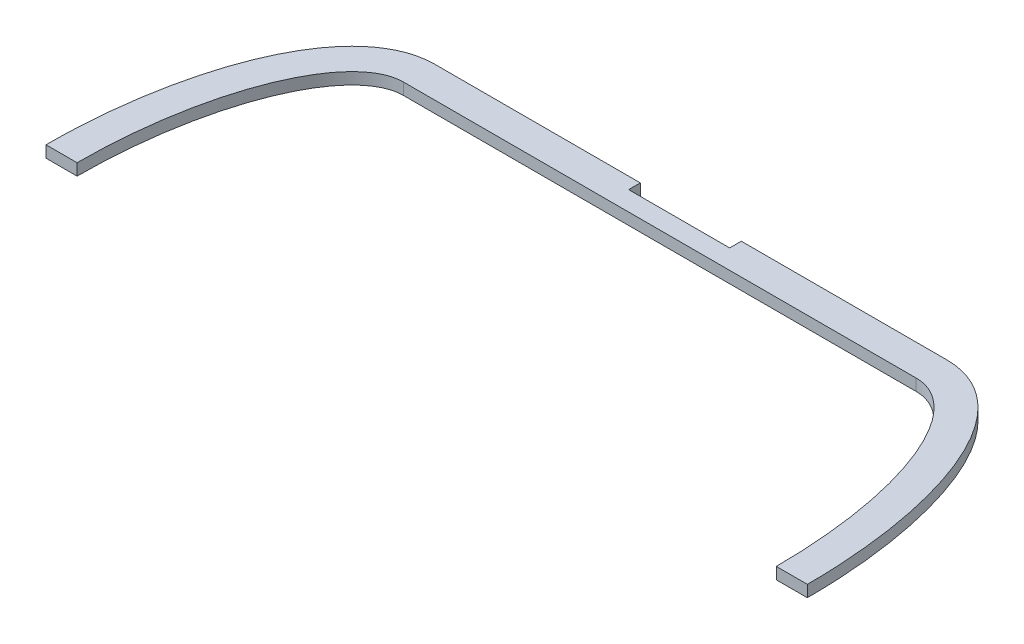
ISO-10303-21;
HEADER;
FILE_DESCRIPTION(('STEP AP214'),'2;1');
FILE_NAME('part.step','',(''),(''),'','','');
FILE_SCHEMA(('AUTOMOTIVE_DESIGN { 1 0 10303 214 1 1 1 1 }'));
ENDSEC;
DATA;
#1=APPLICATION_CONTEXT('core data for automotive mechanical design processes');
#2=APPLICATION_PROTOCOL_DEFINITION('international standard','automotive_design',2000,#1);
#3=PRODUCT_CONTEXT('',#1,'mechanical');
#4=PRODUCT('Part','Part','',(#3));
#5=PRODUCT_RELATED_PRODUCT_CATEGORY('part','',(#4));
#6=PRODUCT_DEFINITION_FORMATION('','',#4);
#7=PRODUCT_DEFINITION_CONTEXT('part definition',#1,'design');
#8=PRODUCT_DEFINITION('design','',#6,#7);
#9=PRODUCT_DEFINITION_SHAPE('','',#8);
#10=(LENGTH_UNIT() NAMED_UNIT(*) SI_UNIT(.MILLI.,.METRE.));
#11=(NAMED_UNIT(*) PLANE_ANGLE_UNIT() SI_UNIT($,.RADIAN.));
#12=(NAMED_UNIT(*) SI_UNIT($,.STERADIAN.) SOLID_ANGLE_UNIT());
#13=UNCERTAINTY_MEASURE_WITH_UNIT(LENGTH_MEASURE(1.E-05),#10,'distance_accuracy_value','');
#14=(GEOMETRIC_REPRESENTATION_CONTEXT(3) GLOBAL_UNCERTAINTY_ASSIGNED_CONTEXT((#13)) GLOBAL_UNIT_ASSIGNED_CONTEXT((#10,
#11,#12)) REPRESENTATION_CONTEXT('',''));
#15=CARTESIAN_POINT('',(0.,0.,0.));
#16=DIRECTION('',(0.,0.,1.));
#17=DIRECTION('',(1.,0.,0.));
#18=AXIS2_PLACEMENT_3D('',#15,#16,#17);
#19=CARTESIAN_POINT('',(-33.,1.5,-34.));
#20=DIRECTION('',(0.,0.,-1.));
#21=DIRECTION('',(-1.,0.,0.));
#22=AXIS2_PLACEMENT_3D('',#19,#20,#21);
#23=PLANE('',#22);
#24=DIRECTION('',(0.,1.,0.));
#25=VECTOR('',#24,1.);
#26=CARTESIAN_POINT('',(-6.5,1.5,-34.));
#27=LINE('',#26,#25);
#28=CARTESIAN_POINT('',(-6.5,0.,-34.));
#29=VERTEX_POINT('',#28);
#30=CARTESIAN_POINT('',(-6.5,1.5,-34.));
#31=VERTEX_POINT('',#30);
#32=EDGE_CURVE('E11',#29,#31,#27,.T.);
#33=ORIENTED_EDGE('',*,*,#32,.F.);
#34=DIRECTION('',(1.,0.,0.));
#35=VECTOR('',#34,1.);
#36=CARTESIAN_POINT('',(-33.,0.,-34.));
#37=LINE('',#36,#35);
#38=CARTESIAN_POINT('',(-33.,0.,-34.));
#39=VERTEX_POINT('',#38);
#40=EDGE_CURVE('E155',#39,#29,#37,.T.);
#41=ORIENTED_EDGE('',*,*,#40,.F.);
#42=DIRECTION('',(0.,-1.,0.));
#43=VECTOR('',#42,1.);
#44=CARTESIAN_POINT('',(-33.,1.5,-34.));
#45=LINE('',#44,#43);
#46=CARTESIAN_POINT('',(-33.,1.5,-34.));
#47=VERTEX_POINT('',#46);
#48=EDGE_CURVE('E249',#47,#39,#45,.T.);
#49=ORIENTED_EDGE('',*,*,#48,.F.);
#50=DIRECTION('',(1.,0.,0.));
#51=VECTOR('',#50,1.);
#52=CARTESIAN_POINT('',(-33.,1.5,-34.));
#53=LINE('',#52,#51);
#54=EDGE_CURVE('E232',#47,#31,#53,.T.);
#55=ORIENTED_EDGE('',*,*,#54,.T.);
#56=EDGE_LOOP('',(#33,#41,#49,#55));
#57=FACE_BOUND('',#56,.T.);
#58=ADVANCED_FACE('F40',(#57),#23,.T.);
#59=CARTESIAN_POINT('',(-33.,1.5,0.));
#60=DIRECTION('',(0.,1.,0.));
#61=DIRECTION('',(0.,0.,1.));
#62=AXIS2_PLACEMENT_3D('',#59,#60,#61);
#63=ELLIPSE('',#62,30.,12.);
#64=DIRECTION('',(0.,-1.,0.));
#65=VECTOR('',#64,1.);
#66=SURFACE_OF_LINEAR_EXTRUSION('',#63,#65);
#67=OFFSET_SURFACE('',#66,-4.,.F.);
#68=DIRECTION('',(0.,-1.,0.));
#69=VECTOR('',#68,1.);
#70=CARTESIAN_POINT('',(-49.,0.75,0.));
#71=LINE('',#70,#69);
#72=CARTESIAN_POINT('',(-49.,1.5,0.));
#73=VERTEX_POINT('',#72);
#74=CARTESIAN_POINT('',(-49.,0.,0.));
#75=VERTEX_POINT('',#74);
#76=EDGE_CURVE('E184',#73,#75,#71,.T.);
#77=ORIENTED_EDGE('',*,*,#76,.F.);
#78=CARTESIAN_POINT('',(-33.,1.5,-34.));
#79=CARTESIAN_POINT('',(-33.1318594620977,1.5,-34.0000020599482));
#80=CARTESIAN_POINT('',(-33.2637006242787,1.5,-33.9970355341147));
#81=CARTESIAN_POINT('',(-33.5271110870535,1.5,-33.9851930390177));
#82=CARTESIAN_POINT('',(-33.6586804003457,1.5,-33.9763173523343));
#83=CARTESIAN_POINT('',(-34.0524260475535,1.5,-33.9408875606357));
#84=CARTESIAN_POINT('',(-34.3138623381053,1.5,-33.9055306264686));
#85=CARTESIAN_POINT('',(-34.8305964091808,1.5,-33.8123523725608));
#86=CARTESIAN_POINT('',(-35.0859257064015,1.5,-33.7547034487541));
#87=CARTESIAN_POINT('',(-35.5907917224365,1.5,-33.6179530744078));
#88=CARTESIAN_POINT('',(-35.8403278339926,1.5,-33.5388493858422));
#89=CARTESIAN_POINT('',(-36.3314711921855,1.5,-33.3607489952492));
#90=CARTESIAN_POINT('',(-36.573096455771,1.5,-33.2618017754368));
#91=CARTESIAN_POINT('',(-37.0479953394521,1.5,-33.0453975077983));
#92=CARTESIAN_POINT('',(-37.2812656129938,1.5,-32.9279331425494));
#93=CARTESIAN_POINT('',(-37.7388156571645,1.5,-32.6760332027823));
#94=CARTESIAN_POINT('',(-37.9630835644682,1.5,-32.5415761440126));
#95=CARTESIAN_POINT('',(-38.4018347424355,1.5,-32.2575102434145));
#96=CARTESIAN_POINT('',(-38.6163154961852,1.5,-32.1078975355798));
#97=CARTESIAN_POINT('',(-39.1532543402919,1.5,-31.7071041076178));
#98=CARTESIAN_POINT('',(-39.4684770078507,1.5,-31.4461846903361));
#99=CARTESIAN_POINT('',(-40.0745432389481,1.5,-30.8974107755337));
#100=CARTESIAN_POINT('',(-40.3653740258298,1.5,-30.6095423269061));
#101=CARTESIAN_POINT('',(-40.924294013386,1.5,-30.0114514760985));
#102=CARTESIAN_POINT('',(-41.1923320370166,1.5,-29.701181518627));
#103=CARTESIAN_POINT('',(-41.7066164563929,1.5,-29.0630483204643));
#104=CARTESIAN_POINT('',(-41.9528563480091,1.5,-28.7351798752964));
#105=CARTESIAN_POINT('',(-42.4712972529298,1.5,-28.0000642978313));
#106=CARTESIAN_POINT('',(-42.7392063418082,1.5,-27.5897993430692));
#107=CARTESIAN_POINT('',(-43.2494781947508,1.5,-26.7534139120122));
#108=CARTESIAN_POINT('',(-43.4918229407119,1.5,-26.3272825352882));
#109=CARTESIAN_POINT('',(-43.9535344011357,1.5,-25.4626566854945));
#110=CARTESIAN_POINT('',(-44.1728945430332,1.5,-25.0241587213834));
#111=CARTESIAN_POINT('',(-44.59130669948,1.5,-24.1366034231867));
#112=CARTESIAN_POINT('',(-44.7903190489005,1.5,-23.6875274883149));
#113=CARTESIAN_POINT('',(-45.1694966695557,1.5,-22.7817322494237));
#114=CARTESIAN_POINT('',(-45.3496694061485,1.5,-22.3250160567792));
#115=CARTESIAN_POINT('',(-45.6929528702929,1.5,-21.4052442104853));
#116=CARTESIAN_POINT('',(-45.856063669406,1.5,-20.942188583434));
#117=CARTESIAN_POINT('',(-46.1764891399855,1.5,-19.9813818243689));
#118=CARTESIAN_POINT('',(-46.3327822108289,1.5,-19.483290910703));
#119=CARTESIAN_POINT('',(-46.6291342184352,1.5,-18.4822739248874));
#120=CARTESIAN_POINT('',(-46.7691917170414,1.5,-17.9793474286655));
#121=CARTESIAN_POINT('',(-47.0343446224069,1.5,-16.9691716008346));
#122=CARTESIAN_POINT('',(-47.1594286517896,1.5,-16.461919291893));
#123=CARTESIAN_POINT('',(-47.3955073552352,1.5,-15.4441265624587));
#124=CARTESIAN_POINT('',(-47.5065012265865,1.5,-14.9335859563724));
#125=CARTESIAN_POINT('',(-47.7152506631777,1.5,-13.9096322212036));
#126=CARTESIAN_POINT('',(-47.8130017850487,1.5,-13.3962181878666));
#127=CARTESIAN_POINT('',(-47.9959021200888,1.5,-12.3671432744908));
#128=CARTESIAN_POINT('',(-48.0810508090306,1.5,-11.8514823019032));
#129=CARTESIAN_POINT('',(-48.3189822028628,1.5,-10.2983699369656));
#130=CARTESIAN_POINT('',(-48.453586223143,1.5,-9.25808852451466));
#131=CARTESIAN_POINT('',(-48.6777395263624,1.5,-7.17331636462823));
#132=CARTESIAN_POINT('',(-48.7673118072923,1.5,-6.12882804099582));
#133=CARTESIAN_POINT('',(-48.9035866922487,1.5,-4.03720573631824));
#134=CARTESIAN_POINT('',(-48.9502953565059,1.5,-2.99007215026959));
#135=CARTESIAN_POINT('',(-48.9979304608906,1.5,-1.05601569894444));
#136=CARTESIAN_POINT('',(-49.0047953518082,1.5,-0.169232157102556));
#137=CARTESIAN_POINT('',(-48.9886876788915,1.5,1.60419145579057));
#138=CARTESIAN_POINT('',(-48.9657111539563,1.5,2.49083149216792));
#139=CARTESIAN_POINT('',(-48.8895397901809,1.5,4.26308182212891));
#140=CARTESIAN_POINT('',(-48.8363359757705,1.5,5.14869173152721));
#141=CARTESIAN_POINT('',(-48.6987998662974,1.5,6.91798779564072));
#142=CARTESIAN_POINT('',(-48.614450737541,1.5,7.80167264959111));
#143=CARTESIAN_POINT('',(-48.4137441725008,1.5,9.56055225063439));
#144=CARTESIAN_POINT('',(-48.2975634838848,1.5,10.4357670281672));
#145=CARTESIAN_POINT('',(-48.0309519792693,1.5,12.1808466106661));
#146=CARTESIAN_POINT('',(-47.8805265524154,1.5,13.0507122353385));
#147=CARTESIAN_POINT('',(-47.5426449389393,1.5,14.7826673737946));
#148=CARTESIAN_POINT('',(-47.3552157164466,1.5,15.644762074639));
#149=CARTESIAN_POINT('',(-47.0433430253094,1.5,16.9300967030071));
#150=CARTESIAN_POINT('',(-46.9343030574677,1.5,17.3571074332168));
#151=CARTESIAN_POINT('',(-46.705323876174,1.5,18.2081897849636));
#152=CARTESIAN_POINT('',(-46.5853850963297,1.5,18.6322615227062));
#153=CARTESIAN_POINT('',(-46.3099613701162,1.5,19.5572920151293));
#154=CARTESIAN_POINT('',(-46.1520544438863,1.5,20.057533520389));
#155=CARTESIAN_POINT('',(-45.8183166797773,1.5,21.0519989533086));
#156=CARTESIAN_POINT('',(-45.642486626955,1.5,21.5462231434742));
#157=CARTESIAN_POINT('',(-45.2708565317141,1.5,22.5279730394365));
#158=CARTESIAN_POINT('',(-45.0750274579593,1.5,23.0154878072719));
#159=CARTESIAN_POINT('',(-44.661479868201,1.5,23.9811878173337));
#160=CARTESIAN_POINT('',(-44.44376152471,1.5,24.4593731330514));
#161=CARTESIAN_POINT('',(-43.981992283357,1.5,25.4077760171269));
#162=CARTESIAN_POINT('',(-43.7377404767102,1.5,25.8778963596938));
#163=CARTESIAN_POINT('',(-43.2212194112808,1.5,26.8027348642167));
#164=CARTESIAN_POINT('',(-42.9489444140762,1.5,27.2574498461149));
#165=CARTESIAN_POINT('',(-42.3735126923934,1.5,28.1456018489968));
#166=CARTESIAN_POINT('',(-42.0704261602621,1.5,28.5790840418468));
#167=CARTESIAN_POINT('',(-41.4291529915261,1.5,29.4192156910943));
#168=CARTESIAN_POINT('',(-41.0909897691264,1.5,29.8258827541572));
#169=CARTESIAN_POINT('',(-40.5278308199835,1.5,30.4385851206157));
#170=CARTESIAN_POINT('',(-40.3157240969554,1.5,30.6565141601795));
#171=CARTESIAN_POINT('',(-39.878127855667,1.5,31.0786383339111));
#172=CARTESIAN_POINT('',(-39.6526365904152,1.5,31.2828316677996));
#173=CARTESIAN_POINT('',(-39.1879603805882,1.5,31.6751775758266));
#174=CARTESIAN_POINT('',(-38.9487721248127,1.5,31.8633262436252));
#175=CARTESIAN_POINT('',(-38.4568919659684,1.5,32.2209113286117));
#176=CARTESIAN_POINT('',(-38.204205918611,1.5,32.390355763932));
#177=CARTESIAN_POINT('',(-37.6826037333005,1.5,32.7098471927893));
#178=CARTESIAN_POINT('',(-37.4135290937558,1.5,32.8596367230878));
#179=CARTESIAN_POINT('',(-36.8629856959038,1.5,33.1346097997704));
#180=CARTESIAN_POINT('',(-36.5815153949178,1.5,33.2597902728279));
#181=CARTESIAN_POINT('',(-36.0085391685868,1.5,33.4826454962346));
#182=CARTESIAN_POINT('',(-35.7170562164389,1.5,33.5803790342088));
#183=CARTESIAN_POINT('',(-35.125969633301,1.5,33.7463976127401));
#184=CARTESIAN_POINT('',(-34.8263712656585,1.5,33.8147012763248));
#185=CARTESIAN_POINT('',(-34.2725560161592,1.5,33.9114016006083));
#186=CARTESIAN_POINT('',(-34.0191717396856,1.5,33.9445750899428));
#187=CARTESIAN_POINT('',(-33.6377179083465,1.5,33.9778013169971));
#188=CARTESIAN_POINT('',(-33.5103278684717,1.5,33.986121061806));
#189=CARTESIAN_POINT('',(-33.2552966943805,1.5,33.9972218002038));
#190=CARTESIAN_POINT('',(-33.1276555410585,1.5,34.0000023546415));
#191=CARTESIAN_POINT('',(-33.,1.5,34.));
#192=B_SPLINE_CURVE_WITH_KNOTS('',3,(#78,#79,#80,#81,#82,#83,#84,#85,#86,#87,#88,#89,#90,#91,
#92,#93,#94,#95,#96,#97,#98,#99,#100,#101,#102,#103,#104,#105,#106,#107,#108,#109,#110,#111,
#112,#113,#114,#115,#116,#117,#118,#119,#120,#121,#122,#123,#124,#125,#126,#127,#128,#129,#130,
#131,#132,#133,#134,#135,#136,#137,#138,#139,#140,#141,#142,#143,#144,#145,#146,#147,#148,#149,
#150,#151,#152,#153,#154,#155,#156,#157,#158,#159,#160,#161,#162,#163,#164,#165,#166,#167,#168,
#169,#170,#171,#172,#173,#174,#175,#176,#177,#178,#179,#180,#181,#182,#183,#184,#185,#186,#187,
#188,#189,#190,#191),.UNSPECIFIED.,.F.,.F.,(4,2,2,2,2,2,2,2,2,2,2,2,2,2,2,2,2,2,2,2,2,2,2,2,2,2,
2,2,2,2,2,2,2,2,2,2,2,2,2,2,2,2,2,2,2,2,2,2,2,2,2,2,2,2,2,2,4),(0.,0.395508836014187,
0.790998759870364,1.58131428167553,2.3656363114628,3.15004018827493,3.93251185206918,
4.71529350401624,5.49907493574531,6.28305680565762,7.50867229476685,8.7349258126237,
9.96386370828232,11.1931670672531,12.6620278715481,14.1319171277453,15.6022255657429,
17.0753476019005,18.5478836708645,20.0204135634422,21.5862179857611,23.1521610021457,
24.7192864253178,26.2865010870783,27.8542403042732,29.4220447168738,32.5677400507569,
35.7118272222425,38.8554698015129,41.5154187918589,44.1757208955869,46.8368133519216,
49.499346209299,52.147384676482,54.7950067056158,57.4407065247341,58.7627261438731,
60.0846931896487,61.6580971759044,63.231432274565,64.8070846568383,66.3827246221411,
67.9712586192657,69.5601185565721,71.1454367174265,72.7297033832918,73.6415262024059,
74.5534682982544,75.4656317913664,76.3774027270191,77.3001263347647,78.2229651046637,
79.1438119355043,80.0640752017713,80.8297204129566,81.2125979873055,81.5955059152856),.UNSPECIFIED.);
#193=EDGE_CURVE('E215',#47,#73,#192,.T.);
#194=ORIENTED_EDGE('',*,*,#193,.F.);
#195=ORIENTED_EDGE('',*,*,#48,.T.);
#196=CARTESIAN_POINT('',(-33.,0.,-34.));
#197=CARTESIAN_POINT('',(-33.1318594620977,0.,-34.0000020599482));
#198=CARTESIAN_POINT('',(-33.2637006242787,0.,-33.9970355341147));
#199=CARTESIAN_POINT('',(-33.5271110870535,0.,-33.9851930390177));
#200=CARTESIAN_POINT('',(-33.6586804003457,0.,-33.9763173523343));
#201=CARTESIAN_POINT('',(-34.0524260475535,0.,-33.9408875606357));
#202=CARTESIAN_POINT('',(-34.3138623381053,0.,-33.9055306264686));
#203=CARTESIAN_POINT('',(-34.8305964091808,0.,-33.8123523725608));
#204=CARTESIAN_POINT('',(-35.0859257064015,0.,-33.7547034487541));
#205=CARTESIAN_POINT('',(-35.5907917224365,0.,-33.6179530744078));
#206=CARTESIAN_POINT('',(-35.8403278339926,0.,-33.5388493858422));
#207=CARTESIAN_POINT('',(-36.3314711921855,0.,-33.3607489952492));
#208=CARTESIAN_POINT('',(-36.573096455771,0.,-33.2618017754368));
#209=CARTESIAN_POINT('',(-37.0479953394521,0.,-33.0453975077983));
#210=CARTESIAN_POINT('',(-37.2812656129938,0.,-32.9279331425494));
#211=CARTESIAN_POINT('',(-37.7388156571645,0.,-32.6760332027823));
#212=CARTESIAN_POINT('',(-37.9630835644682,0.,-32.5415761440126));
#213=CARTESIAN_POINT('',(-38.4018347424355,0.,-32.2575102434145));
#214=CARTESIAN_POINT('',(-38.6163154961852,0.,-32.1078975355798));
#215=CARTESIAN_POINT('',(-39.1532543402919,0.,-31.7071041076178));
#216=CARTESIAN_POINT('',(-39.4684770078507,0.,-31.4461846903361));
#217=CARTESIAN_POINT('',(-40.0745432389481,0.,-30.8974107755337));
#218=CARTESIAN_POINT('',(-40.3653740258298,0.,-30.6095423269061));
#219=CARTESIAN_POINT('',(-40.924294013386,0.,-30.0114514760985));
#220=CARTESIAN_POINT('',(-41.1923320370166,0.,-29.701181518627));
#221=CARTESIAN_POINT('',(-41.7066164563929,0.,-29.0630483204643));
#222=CARTESIAN_POINT('',(-41.9528563480091,0.,-28.7351798752964));
#223=CARTESIAN_POINT('',(-42.4712972529298,0.,-28.0000642978313));
#224=CARTESIAN_POINT('',(-42.7392063418082,0.,-27.5897993430692));
#225=CARTESIAN_POINT('',(-43.2494781947508,0.,-26.7534139120122));
#226=CARTESIAN_POINT('',(-43.4918229407119,0.,-26.3272825352882));
#227=CARTESIAN_POINT('',(-43.9535344011357,0.,-25.4626566854945));
#228=CARTESIAN_POINT('',(-44.1728945430332,0.,-25.0241587213834));
#229=CARTESIAN_POINT('',(-44.59130669948,0.,-24.1366034231867));
#230=CARTESIAN_POINT('',(-44.7903190489005,0.,-23.6875274883149));
#231=CARTESIAN_POINT('',(-45.1694966695557,0.,-22.7817322494237));
#232=CARTESIAN_POINT('',(-45.3496694061485,0.,-22.3250160567792));
#233=CARTESIAN_POINT('',(-45.6929528702929,0.,-21.4052442104853));
#234=CARTESIAN_POINT('',(-45.856063669406,0.,-20.942188583434));
#235=CARTESIAN_POINT('',(-46.1764891399855,0.,-19.9813818243689));
#236=CARTESIAN_POINT('',(-46.3327822108289,0.,-19.483290910703));
#237=CARTESIAN_POINT('',(-46.6291342184352,0.,-18.4822739248874));
#238=CARTESIAN_POINT('',(-46.7691917170414,0.,-17.9793474286655));
#239=CARTESIAN_POINT('',(-47.0343446224069,0.,-16.9691716008346));
#240=CARTESIAN_POINT('',(-47.1594286517896,0.,-16.461919291893));
#241=CARTESIAN_POINT('',(-47.3955073552352,0.,-15.4441265624587));
#242=CARTESIAN_POINT('',(-47.5065012265865,0.,-14.9335859563724));
#243=CARTESIAN_POINT('',(-47.7152506631777,0.,-13.9096322212036));
#244=CARTESIAN_POINT('',(-47.8130017850487,0.,-13.3962181878666));
#245=CARTESIAN_POINT('',(-47.9959021200888,0.,-12.3671432744908));
#246=CARTESIAN_POINT('',(-48.0810508090306,0.,-11.8514823019032));
#247=CARTESIAN_POINT('',(-48.3189822028628,0.,-10.2983699369656));
#248=CARTESIAN_POINT('',(-48.453586223143,0.,-9.25808852451466));
#249=CARTESIAN_POINT('',(-48.6777395263624,0.,-7.17331636462823));
#250=CARTESIAN_POINT('',(-48.7673118072923,0.,-6.12882804099582));
#251=CARTESIAN_POINT('',(-48.9035866922487,0.,-4.03720573631824));
#252=CARTESIAN_POINT('',(-48.9502953565059,0.,-2.99007215026959));
#253=CARTESIAN_POINT('',(-48.9979304608906,0.,-1.05601569894444));
#254=CARTESIAN_POINT('',(-49.0047953518082,0.,-0.169232157102556));
#255=CARTESIAN_POINT('',(-48.9886876788915,0.,1.60419145579057));
#256=CARTESIAN_POINT('',(-48.9657111539563,0.,2.49083149216792));
#257=CARTESIAN_POINT('',(-48.8895397901809,0.,4.26308182212891));
#258=CARTESIAN_POINT('',(-48.8363359757705,0.,5.14869173152721));
#259=CARTESIAN_POINT('',(-48.6987998662974,0.,6.91798779564072));
#260=CARTESIAN_POINT('',(-48.614450737541,0.,7.80167264959111));
#261=CARTESIAN_POINT('',(-48.4137441725008,0.,9.56055225063439));
#262=CARTESIAN_POINT('',(-48.2975634838848,0.,10.4357670281672));
#263=CARTESIAN_POINT('',(-48.0309519792693,0.,12.1808466106661));
#264=CARTESIAN_POINT('',(-47.8805265524154,0.,13.0507122353385));
#265=CARTESIAN_POINT('',(-47.5426449389393,0.,14.7826673737946));
#266=CARTESIAN_POINT('',(-47.3552157164466,0.,15.644762074639));
#267=CARTESIAN_POINT('',(-47.0433430253094,0.,16.9300967030071));
#268=CARTESIAN_POINT('',(-46.9343030574677,0.,17.3571074332168));
#269=CARTESIAN_POINT('',(-46.705323876174,0.,18.2081897849636));
#270=CARTESIAN_POINT('',(-46.5853850963297,0.,18.6322615227062));
#271=CARTESIAN_POINT('',(-46.3099613701162,0.,19.5572920151293));
#272=CARTESIAN_POINT('',(-46.1520544438863,0.,20.057533520389));
#273=CARTESIAN_POINT('',(-45.8183166797773,0.,21.0519989533086));
#274=CARTESIAN_POINT('',(-45.642486626955,0.,21.5462231434742));
#275=CARTESIAN_POINT('',(-45.2708565317141,0.,22.5279730394365));
#276=CARTESIAN_POINT('',(-45.0750274579593,0.,23.0154878072719));
#277=CARTESIAN_POINT('',(-44.661479868201,0.,23.9811878173337));
#278=CARTESIAN_POINT('',(-44.44376152471,0.,24.4593731330514));
#279=CARTESIAN_POINT('',(-43.981992283357,0.,25.4077760171269));
#280=CARTESIAN_POINT('',(-43.7377404767102,0.,25.8778963596938));
#281=CARTESIAN_POINT('',(-43.2212194112808,0.,26.8027348642167));
#282=CARTESIAN_POINT('',(-42.9489444140762,0.,27.2574498461149));
#283=CARTESIAN_POINT('',(-42.3735126923934,0.,28.1456018489968));
#284=CARTESIAN_POINT('',(-42.0704261602621,0.,28.5790840418468));
#285=CARTESIAN_POINT('',(-41.4291529915261,0.,29.4192156910943));
#286=CARTESIAN_POINT('',(-41.0909897691264,0.,29.8258827541572));
#287=CARTESIAN_POINT('',(-40.5278308199835,0.,30.4385851206157));
#288=CARTESIAN_POINT('',(-40.3157240969554,0.,30.6565141601795));
#289=CARTESIAN_POINT('',(-39.878127855667,0.,31.0786383339111));
#290=CARTESIAN_POINT('',(-39.6526365904152,0.,31.2828316677996));
#291=CARTESIAN_POINT('',(-39.1879603805882,0.,31.6751775758266));
#292=CARTESIAN_POINT('',(-38.9487721248127,0.,31.8633262436252));
#293=CARTESIAN_POINT('',(-38.4568919659684,0.,32.2209113286117));
#294=CARTESIAN_POINT('',(-38.204205918611,0.,32.390355763932));
#295=CARTESIAN_POINT('',(-37.6826037333005,0.,32.7098471927893));
#296=CARTESIAN_POINT('',(-37.4135290937558,0.,32.8596367230878));
#297=CARTESIAN_POINT('',(-36.8629856959038,0.,33.1346097997704));
#298=CARTESIAN_POINT('',(-36.5815153949178,0.,33.2597902728279));
#299=CARTESIAN_POINT('',(-36.0085391685868,0.,33.4826454962346));
#300=CARTESIAN_POINT('',(-35.7170562164389,0.,33.5803790342088));
#301=CARTESIAN_POINT('',(-35.125969633301,0.,33.7463976127401));
#302=CARTESIAN_POINT('',(-34.8263712656585,0.,33.8147012763248));
#303=CARTESIAN_POINT('',(-34.2725560161592,0.,33.9114016006083));
#304=CARTESIAN_POINT('',(-34.0191717396856,0.,33.9445750899428));
#305=CARTESIAN_POINT('',(-33.6377179083465,0.,33.9778013169971));
#306=CARTESIAN_POINT('',(-33.5103278684717,0.,33.986121061806));
#307=CARTESIAN_POINT('',(-33.2552966943805,0.,33.9972218002038));
#308=CARTESIAN_POINT('',(-33.1276555410585,0.,34.0000023546415));
#309=CARTESIAN_POINT('',(-33.,0.,34.));
#310=B_SPLINE_CURVE_WITH_KNOTS('',3,(#196,#197,#198,#199,#200,#201,#202,#203,#204,#205,#206,
#207,#208,#209,#210,#211,#212,#213,#214,#215,#216,#217,#218,#219,#220,#221,#222,#223,#224,#225,
#226,#227,#228,#229,#230,#231,#232,#233,#234,#235,#236,#237,#238,#239,#240,#241,#242,#243,#244,
#245,#246,#247,#248,#249,#250,#251,#252,#253,#254,#255,#256,#257,#258,#259,#260,#261,#262,#263,
#264,#265,#266,#267,#268,#269,#270,#271,#272,#273,#274,#275,#276,#277,#278,#279,#280,#281,#282,
#283,#284,#285,#286,#287,#288,#289,#290,#291,#292,#293,#294,#295,#296,#297,#298,#299,#300,#301,
#302,#303,#304,#305,#306,#307,#308,#309),.UNSPECIFIED.,.F.,.F.,(4,2,2,2,2,2,2,2,2,2,2,2,2,2,2,2,
2,2,2,2,2,2,2,2,2,2,2,2,2,2,2,2,2,2,2,2,2,2,2,2,2,2,2,2,2,2,2,2,2,2,2,2,2,2,2,2,4),(0.,
0.395508836014187,0.790998759870364,1.58131428167553,2.3656363114628,3.15004018827493,
3.93251185206918,4.71529350401624,5.49907493574531,6.28305680565762,7.50867229476685,
8.7349258126237,9.96386370828232,11.1931670672531,12.6620278715481,14.1319171277453,
15.6022255657429,17.0753476019005,18.5478836708645,20.0204135634422,21.5862179857611,
23.1521610021457,24.7192864253178,26.2865010870783,27.8542403042732,29.4220447168738,
32.5677400507569,35.7118272222425,38.8554698015129,41.5154187918589,44.1757208955869,
46.8368133519216,49.499346209299,52.147384676482,54.7950067056158,57.4407065247341,
58.7627261438731,60.0846931896487,61.6580971759044,63.231432274565,64.8070846568383,
66.3827246221411,67.9712586192657,69.5601185565721,71.1454367174265,72.7297033832918,
73.6415262024059,74.5534682982544,75.4656317913664,76.3774027270191,77.3001263347647,
78.2229651046637,79.1438119355043,80.0640752017713,80.8297204129566,81.2125979873055,
81.5955059152856),.UNSPECIFIED.);
#311=EDGE_CURVE('E257',#39,#75,#310,.T.);
#312=ORIENTED_EDGE('',*,*,#311,.T.);
#313=EDGE_LOOP('',(#77,#194,#195,#312));
#314=FACE_BOUND('',#313,.T.);
#315=ADVANCED_FACE('F236',(#314),#67,.F.);
#316=CARTESIAN_POINT('',(33.,1.5,0.));
#317=DIRECTION('',(0.,-1.,0.));
#318=DIRECTION('',(0.,0.,1.));
#319=AXIS2_PLACEMENT_3D('',#316,#317,#318);
#320=ELLIPSE('',#319,30.,12.);
#321=DIRECTION('',(0.,-1.,0.));
#322=VECTOR('',#321,1.);
#323=SURFACE_OF_LINEAR_EXTRUSION('',#320,#322);
#324=OFFSET_SURFACE('',#323,4.,.F.);
#325=CARTESIAN_POINT('',(33.,1.5,-34.));
#326=CARTESIAN_POINT('',(33.1318594620977,1.5,-34.0000020599482));
#327=CARTESIAN_POINT('',(33.2637006242787,1.5,-33.9970355341147));
#328=CARTESIAN_POINT('',(33.5271110870536,1.5,-33.9851930390177));
#329=CARTESIAN_POINT('',(33.6586804003457,1.5,-33.9763173523343));
#330=CARTESIAN_POINT('',(34.0524260475535,1.5,-33.9408875606357));
#331=CARTESIAN_POINT('',(34.3138623381053,1.5,-33.9055306264686));
#332=CARTESIAN_POINT('',(34.8305964091809,1.5,-33.8123523725608));
#333=CARTESIAN_POINT('',(35.0859257064015,1.5,-33.7547034487541));
#334=CARTESIAN_POINT('',(35.5907917224366,1.5,-33.6179530744078));
#335=CARTESIAN_POINT('',(35.8403278339927,1.5,-33.5388493858422));
#336=CARTESIAN_POINT('',(36.3314711921855,1.5,-33.3607489952492));
#337=CARTESIAN_POINT('',(36.573096455771,1.5,-33.2618017754368));
#338=CARTESIAN_POINT('',(37.0479953394522,1.5,-33.0453975077983));
#339=CARTESIAN_POINT('',(37.2812656129938,1.5,-32.9279331425494));
#340=CARTESIAN_POINT('',(37.7388156571646,1.5,-32.6760332027822));
#341=CARTESIAN_POINT('',(37.9630835644682,1.5,-32.5415761440126));
#342=CARTESIAN_POINT('',(38.4018347424356,1.5,-32.2575102434144));
#343=CARTESIAN_POINT('',(38.6163154961852,1.5,-32.1078975355798));
#344=CARTESIAN_POINT('',(39.1532543402919,1.5,-31.7071041076178));
#345=CARTESIAN_POINT('',(39.4684770078507,1.5,-31.446184690336));
#346=CARTESIAN_POINT('',(40.0745432389481,1.5,-30.8974107755336));
#347=CARTESIAN_POINT('',(40.3653740258299,1.5,-30.6095423269061));
#348=CARTESIAN_POINT('',(40.9242940133861,1.5,-30.0114514760985));
#349=CARTESIAN_POINT('',(41.1923320370166,1.5,-29.7011815186269));
#350=CARTESIAN_POINT('',(41.706616456393,1.5,-29.0630483204643));
#351=CARTESIAN_POINT('',(41.9528563480091,1.5,-28.7351798752963));
#352=CARTESIAN_POINT('',(42.4712972529298,1.5,-28.0000642978313));
#353=CARTESIAN_POINT('',(42.7392063418083,1.5,-27.5897993430691));
#354=CARTESIAN_POINT('',(43.2494781947508,1.5,-26.7534139120122));
#355=CARTESIAN_POINT('',(43.4918229407119,1.5,-26.3272825352881));
#356=CARTESIAN_POINT('',(43.9535344011357,1.5,-25.4626566854944));
#357=CARTESIAN_POINT('',(44.1728945430332,1.5,-25.0241587213833));
#358=CARTESIAN_POINT('',(44.5913066994801,1.5,-24.1366034231866));
#359=CARTESIAN_POINT('',(44.7903190489005,1.5,-23.6875274883148));
#360=CARTESIAN_POINT('',(45.1694966695558,1.5,-22.7817322494236));
#361=CARTESIAN_POINT('',(45.3496694061486,1.5,-22.3250160567791));
#362=CARTESIAN_POINT('',(45.692952870293,1.5,-21.4052442104852));
#363=CARTESIAN_POINT('',(45.8560636694061,1.5,-20.9421885834339));
#364=CARTESIAN_POINT('',(46.1764891399856,1.5,-19.9813818243687));
#365=CARTESIAN_POINT('',(46.332782210829,1.5,-19.4832909107029));
#366=CARTESIAN_POINT('',(46.6291342184352,1.5,-18.4822739248873));
#367=CARTESIAN_POINT('',(46.7691917170415,1.5,-17.9793474286653));
#368=CARTESIAN_POINT('',(47.034344622407,1.5,-16.9691716008345));
#369=CARTESIAN_POINT('',(47.1594286517897,1.5,-16.4619192918928));
#370=CARTESIAN_POINT('',(47.3955073552353,1.5,-15.4441265624586));
#371=CARTESIAN_POINT('',(47.5065012265866,1.5,-14.9335859563722));
#372=CARTESIAN_POINT('',(47.7152506631777,1.5,-13.9096322212035));
#373=CARTESIAN_POINT('',(47.8130017850488,1.5,-13.3962181878665));
#374=CARTESIAN_POINT('',(47.9959021200888,1.5,-12.3671432744906));
#375=CARTESIAN_POINT('',(48.0810508090306,1.5,-11.851482301903));
#376=CARTESIAN_POINT('',(48.3189822028629,1.5,-10.2983699369654));
#377=CARTESIAN_POINT('',(48.453586223143,1.5,-9.25808852451447));
#378=CARTESIAN_POINT('',(48.6777395263624,1.5,-7.17331636462802));
#379=CARTESIAN_POINT('',(48.7673118072923,1.5,-6.12882804099561));
#380=CARTESIAN_POINT('',(48.9035866922487,1.5,-4.03720573631802));
#381=CARTESIAN_POINT('',(48.9502953565059,1.5,-2.99007215026935));
#382=CARTESIAN_POINT('',(48.9979304608906,1.5,-1.0560156989442));
#383=CARTESIAN_POINT('',(49.0047953518082,1.5,-0.169232157102302));
#384=CARTESIAN_POINT('',(48.9886876788915,1.5,1.60419145579083));
#385=CARTESIAN_POINT('',(48.9657111539563,1.5,2.4908314921682));
#386=CARTESIAN_POINT('',(48.8895397901809,1.5,4.26308182212921));
#387=CARTESIAN_POINT('',(48.8363359757705,1.5,5.1486917315275));
#388=CARTESIAN_POINT('',(48.6987998662973,1.5,6.91798779564103));
#389=CARTESIAN_POINT('',(48.614450737541,1.5,7.80167264959143));
#390=CARTESIAN_POINT('',(48.4137441725008,1.5,9.56055225063472));
#391=CARTESIAN_POINT('',(48.2975634838848,1.5,10.4357670281675));
#392=CARTESIAN_POINT('',(48.0309519792692,1.5,12.1808466106664));
#393=CARTESIAN_POINT('',(47.8805265524154,1.5,13.0507122353389));
#394=CARTESIAN_POINT('',(47.5426449389392,1.5,14.782667373795));
#395=CARTESIAN_POINT('',(47.3552157164465,1.5,15.6447620746394));
#396=CARTESIAN_POINT('',(47.0433430253093,1.5,16.9300967030075));
#397=CARTESIAN_POINT('',(46.9343030574676,1.5,17.3571074332172));
#398=CARTESIAN_POINT('',(46.7053238761739,1.5,18.208189784964));
#399=CARTESIAN_POINT('',(46.5853850963296,1.5,18.6322615227066));
#400=CARTESIAN_POINT('',(46.3099613701161,1.5,19.5572920151297));
#401=CARTESIAN_POINT('',(46.1520544438862,1.5,20.0575335203894));
#402=CARTESIAN_POINT('',(45.8183166797772,1.5,21.0519989533089));
#403=CARTESIAN_POINT('',(45.6424866269549,1.5,21.5462231434745));
#404=CARTESIAN_POINT('',(45.270856531714,1.5,22.5279730394369));
#405=CARTESIAN_POINT('',(45.0750274579591,1.5,23.0154878072722));
#406=CARTESIAN_POINT('',(44.6614798682008,1.5,23.981187817334));
#407=CARTESIAN_POINT('',(44.4437615247099,1.5,24.4593731330517));
#408=CARTESIAN_POINT('',(43.9819922833569,1.5,25.4077760171272));
#409=CARTESIAN_POINT('',(43.7377404767101,1.5,25.8778963596941));
#410=CARTESIAN_POINT('',(43.2212194112807,1.5,26.802734864217));
#411=CARTESIAN_POINT('',(42.9489444140761,1.5,27.2574498461151));
#412=CARTESIAN_POINT('',(42.3735126923932,1.5,28.145601848997));
#413=CARTESIAN_POINT('',(42.0704261602619,1.5,28.579084041847));
#414=CARTESIAN_POINT('',(41.429152991526,1.5,29.4192156910945));
#415=CARTESIAN_POINT('',(41.0909897691263,1.5,29.8258827541573));
#416=CARTESIAN_POINT('',(40.5278308199834,1.5,30.4385851206158));
#417=CARTESIAN_POINT('',(40.3157240969553,1.5,30.6565141601796));
#418=CARTESIAN_POINT('',(39.8781278556668,1.5,31.0786383339112));
#419=CARTESIAN_POINT('',(39.6526365904151,1.5,31.2828316677998));
#420=CARTESIAN_POINT('',(39.1879603805881,1.5,31.6751775758267));
#421=CARTESIAN_POINT('',(38.9487721248125,1.5,31.8633262436253));
#422=CARTESIAN_POINT('',(38.4568919659683,1.5,32.2209113286118));
#423=CARTESIAN_POINT('',(38.2042059186109,1.5,32.390355763932));
#424=CARTESIAN_POINT('',(37.6826037333004,1.5,32.7098471927894));
#425=CARTESIAN_POINT('',(37.4135290937557,1.5,32.8596367230879));
#426=CARTESIAN_POINT('',(36.8629856959037,1.5,33.1346097997705));
#427=CARTESIAN_POINT('',(36.5815153949177,1.5,33.259790272828));
#428=CARTESIAN_POINT('',(36.0085391685867,1.5,33.4826454962346));
#429=CARTESIAN_POINT('',(35.7170562164388,1.5,33.5803790342089));
#430=CARTESIAN_POINT('',(35.1259696333009,1.5,33.7463976127401));
#431=CARTESIAN_POINT('',(34.8263712656584,1.5,33.8147012763248));
#432=CARTESIAN_POINT('',(34.2725560161592,1.5,33.9114016006083));
#433=CARTESIAN_POINT('',(34.0191717396855,1.5,33.9445750899428));
#434=CARTESIAN_POINT('',(33.6377179083464,1.5,33.9778013169971));
#435=CARTESIAN_POINT('',(33.5103278684717,1.5,33.986121061806));
#436=CARTESIAN_POINT('',(33.2552966943805,1.5,33.9972218002038));
#437=CARTESIAN_POINT('',(33.1276555410585,1.5,34.0000023546415));
#438=CARTESIAN_POINT('',(33.,1.5,34.));
#439=B_SPLINE_CURVE_WITH_KNOTS('',3,(#325,#326,#327,#328,#329,#330,#331,#332,#333,#334,#335,
#336,#337,#338,#339,#340,#341,#342,#343,#344,#345,#346,#347,#348,#349,#350,#351,#352,#353,#354,
#355,#356,#357,#358,#359,#360,#361,#362,#363,#364,#365,#366,#367,#368,#369,#370,#371,#372,#373,
#374,#375,#376,#377,#378,#379,#380,#381,#382,#383,#384,#385,#386,#387,#388,#389,#390,#391,#392,
#393,#394,#395,#396,#397,#398,#399,#400,#401,#402,#403,#404,#405,#406,#407,#408,#409,#410,#411,
#412,#413,#414,#415,#416,#417,#418,#419,#420,#421,#422,#423,#424,#425,#426,#427,#428,#429,#430,
#431,#432,#433,#434,#435,#436,#437,#438),.UNSPECIFIED.,.F.,.F.,(4,2,2,2,2,2,2,2,2,2,2,2,2,2,2,2,
2,2,2,2,2,2,2,2,2,2,2,2,2,2,2,2,2,2,2,2,2,2,2,2,2,2,2,2,2,2,2,2,2,2,2,2,2,2,2,2,4),(0.,
0.395508836014194,0.790998759870364,1.58131428167553,2.3656363114628,3.15004018827493,
3.93251185206919,4.71529350401626,5.49907493574532,6.28305680565762,7.50867229476686,
8.73492581262373,9.96386370828235,11.1931670672532,12.6620278715481,14.1319171277453,
15.6022255657429,17.0753476019006,18.5478836708646,20.0204135634424,21.5862179857612,
23.1521610021458,24.719286425318,26.2865010870785,27.8542403042734,29.422044716874,
32.5677400507571,35.7118272222427,38.8554698015131,41.5154187918592,44.1757208955872,
46.8368133519219,49.4993462092993,52.1473846764823,54.7950067056161,57.4407065247345,
58.7627261438735,60.0846931896491,61.6580971759048,63.2314322745653,64.8070846568386,
66.3827246221414,67.9712586192659,69.5601185565723,71.1454367174267,72.729703383292,
73.6415262024061,74.5534682982545,75.4656317913666,76.3774027270192,77.3001263347648,
78.2229651046638,79.1438119355044,80.0640752017714,80.8297204129567,81.2125979873055,
81.5955059152856),.UNSPECIFIED.);
#440=CARTESIAN_POINT('',(33.,1.5,-34.));
#441=VERTEX_POINT('',#440);
#442=CARTESIAN_POINT('',(49.,1.5,0.));
#443=VERTEX_POINT('',#442);
#444=EDGE_CURVE('E223',#441,#443,#439,.T.);
#445=ORIENTED_EDGE('',*,*,#444,.T.);
#446=DIRECTION('',(0.,-1.,0.));
#447=VECTOR('',#446,1.);
#448=CARTESIAN_POINT('',(49.,0.75,0.));
#449=LINE('',#448,#447);
#450=CARTESIAN_POINT('',(49.,0.,0.));
#451=VERTEX_POINT('',#450);
#452=EDGE_CURVE('E180',#443,#451,#449,.T.);
#453=ORIENTED_EDGE('',*,*,#452,.T.);
#454=CARTESIAN_POINT('',(33.,0.,-34.));
#455=CARTESIAN_POINT('',(33.1318594620977,0.,-34.0000020599482));
#456=CARTESIAN_POINT('',(33.2637006242787,0.,-33.9970355341147));
#457=CARTESIAN_POINT('',(33.5271110870536,0.,-33.9851930390177));
#458=CARTESIAN_POINT('',(33.6586804003457,0.,-33.9763173523343));
#459=CARTESIAN_POINT('',(34.0524260475535,0.,-33.9408875606357));
#460=CARTESIAN_POINT('',(34.3138623381053,0.,-33.9055306264686));
#461=CARTESIAN_POINT('',(34.8305964091809,0.,-33.8123523725608));
#462=CARTESIAN_POINT('',(35.0859257064015,0.,-33.7547034487541));
#463=CARTESIAN_POINT('',(35.5907917224365,0.,-33.6179530744078));
#464=CARTESIAN_POINT('',(35.8403278339926,0.,-33.5388493858422));
#465=CARTESIAN_POINT('',(36.3314711921855,0.,-33.3607489952492));
#466=CARTESIAN_POINT('',(36.573096455771,0.,-33.2618017754368));
#467=CARTESIAN_POINT('',(37.0479953394521,0.,-33.0453975077983));
#468=CARTESIAN_POINT('',(37.2812656129938,0.,-32.9279331425494));
#469=CARTESIAN_POINT('',(37.7388156571646,0.,-32.6760332027823));
#470=CARTESIAN_POINT('',(37.9630835644682,0.,-32.5415761440126));
#471=CARTESIAN_POINT('',(38.4018347424355,0.,-32.2575102434145));
#472=CARTESIAN_POINT('',(38.6163154961852,0.,-32.1078975355798));
#473=CARTESIAN_POINT('',(39.1532543402919,0.,-31.7071041076179));
#474=CARTESIAN_POINT('',(39.4684770078507,0.,-31.4461846903361));
#475=CARTESIAN_POINT('',(40.0745432389481,0.,-30.8974107755337));
#476=CARTESIAN_POINT('',(40.3653740258299,0.,-30.6095423269061));
#477=CARTESIAN_POINT('',(40.924294013386,0.,-30.0114514760985));
#478=CARTESIAN_POINT('',(41.1923320370166,0.,-29.701181518627));
#479=CARTESIAN_POINT('',(41.7066164563929,0.,-29.0630483204643));
#480=CARTESIAN_POINT('',(41.9528563480091,0.,-28.7351798752964));
#481=CARTESIAN_POINT('',(42.4712972529298,0.,-28.0000642978313));
#482=CARTESIAN_POINT('',(42.7392063418082,0.,-27.5897993430692));
#483=CARTESIAN_POINT('',(43.2494781947508,0.,-26.7534139120122));
#484=CARTESIAN_POINT('',(43.4918229407119,0.,-26.3272825352882));
#485=CARTESIAN_POINT('',(43.9535344011357,0.,-25.4626566854945));
#486=CARTESIAN_POINT('',(44.1728945430332,0.,-25.0241587213833));
#487=CARTESIAN_POINT('',(44.59130669948,0.,-24.1366034231867));
#488=CARTESIAN_POINT('',(44.7903190489005,0.,-23.6875274883149));
#489=CARTESIAN_POINT('',(45.1694966695557,0.,-22.7817322494237));
#490=CARTESIAN_POINT('',(45.3496694061486,0.,-22.3250160567792));
#491=CARTESIAN_POINT('',(45.692952870293,0.,-21.4052442104853));
#492=CARTESIAN_POINT('',(45.856063669406,0.,-20.942188583434));
#493=CARTESIAN_POINT('',(46.1764891399855,0.,-19.9813818243688));
#494=CARTESIAN_POINT('',(46.3327822108289,0.,-19.483290910703));
#495=CARTESIAN_POINT('',(46.6291342184352,0.,-18.4822739248874));
#496=CARTESIAN_POINT('',(46.7691917170415,0.,-17.9793474286654));
#497=CARTESIAN_POINT('',(47.0343446224069,0.,-16.9691716008346));
#498=CARTESIAN_POINT('',(47.1594286517896,0.,-16.4619192918929));
#499=CARTESIAN_POINT('',(47.3955073552352,0.,-15.4441265624587));
#500=CARTESIAN_POINT('',(47.5065012265866,0.,-14.9335859563723));
#501=CARTESIAN_POINT('',(47.7152506631777,0.,-13.9096322212036));
#502=CARTESIAN_POINT('',(47.8130017850488,0.,-13.3962181878666));
#503=CARTESIAN_POINT('',(47.9959021200888,0.,-12.3671432744907));
#504=CARTESIAN_POINT('',(48.0810508090306,0.,-11.8514823019032));
#505=CARTESIAN_POINT('',(48.3189822028628,0.,-10.2983699369656));
#506=CARTESIAN_POINT('',(48.453586223143,0.,-9.25808852451462));
#507=CARTESIAN_POINT('',(48.6777395263624,0.,-7.17331636462818));
#508=CARTESIAN_POINT('',(48.7673118072923,0.,-6.12882804099578));
#509=CARTESIAN_POINT('',(48.9035866922487,0.,-4.0372057363182));
#510=CARTESIAN_POINT('',(48.9502953565059,0.,-2.99007215026955));
#511=CARTESIAN_POINT('',(48.9979304608906,0.,-1.0560156989444));
#512=CARTESIAN_POINT('',(49.0047953518082,0.,-0.169232157102506));
#513=CARTESIAN_POINT('',(48.9886876788916,0.,1.60419145579062));
#514=CARTESIAN_POINT('',(48.9657111539564,0.,2.49083149216798));
#515=CARTESIAN_POINT('',(48.8895397901809,0.,4.26308182212898));
#516=CARTESIAN_POINT('',(48.8363359757705,0.,5.14869173152728));
#517=CARTESIAN_POINT('',(48.6987998662973,0.,6.9179877956408));
#518=CARTESIAN_POINT('',(48.614450737541,0.,7.80167264959119));
#519=CARTESIAN_POINT('',(48.4137441725009,0.,9.56055225063447));
#520=CARTESIAN_POINT('',(48.2975634838848,0.,10.4357670281673));
#521=CARTESIAN_POINT('',(48.0309519792693,0.,12.1808466106661));
#522=CARTESIAN_POINT('',(47.8805265524154,0.,13.0507122353386));
#523=CARTESIAN_POINT('',(47.5426449389393,0.,14.7826673737947));
#524=CARTESIAN_POINT('',(47.3552157164466,0.,15.6447620746391));
#525=CARTESIAN_POINT('',(47.0433430253094,0.,16.9300967030072));
#526=CARTESIAN_POINT('',(46.9343030574677,0.,17.3571074332169));
#527=CARTESIAN_POINT('',(46.7053238761739,0.,18.2081897849637));
#528=CARTESIAN_POINT('',(46.5853850963297,0.,18.6322615227063));
#529=CARTESIAN_POINT('',(46.3099613701162,0.,19.5572920151294));
#530=CARTESIAN_POINT('',(46.1520544438863,0.,20.0575335203891));
#531=CARTESIAN_POINT('',(45.8183166797773,0.,21.0519989533087));
#532=CARTESIAN_POINT('',(45.642486626955,0.,21.5462231434743));
#533=CARTESIAN_POINT('',(45.2708565317141,0.,22.5279730394366));
#534=CARTESIAN_POINT('',(45.0750274579592,0.,23.015487807272));
#535=CARTESIAN_POINT('',(44.6614798682009,0.,23.9811878173337));
#536=CARTESIAN_POINT('',(44.44376152471,0.,24.4593731330515));
#537=CARTESIAN_POINT('',(43.981992283357,0.,25.407776017127));
#538=CARTESIAN_POINT('',(43.7377404767102,0.,25.8778963596939));
#539=CARTESIAN_POINT('',(43.2212194112808,0.,26.8027348642168));
#540=CARTESIAN_POINT('',(42.9489444140762,0.,27.2574498461149));
#541=CARTESIAN_POINT('',(42.3735126923933,0.,28.1456018489968));
#542=CARTESIAN_POINT('',(42.070426160262,0.,28.5790840418468));
#543=CARTESIAN_POINT('',(41.4291529915261,0.,29.4192156910944));
#544=CARTESIAN_POINT('',(41.0909897691264,0.,29.8258827541572));
#545=CARTESIAN_POINT('',(40.5278308199835,0.,30.4385851206157));
#546=CARTESIAN_POINT('',(40.3157240969554,0.,30.6565141601796));
#547=CARTESIAN_POINT('',(39.8781278556669,0.,31.0786383339112));
#548=CARTESIAN_POINT('',(39.6526365904152,0.,31.2828316677997));
#549=CARTESIAN_POINT('',(39.1879603805882,0.,31.6751775758266));
#550=CARTESIAN_POINT('',(38.9487721248126,0.,31.8633262436252));
#551=CARTESIAN_POINT('',(38.4568919659684,0.,32.2209113286118));
#552=CARTESIAN_POINT('',(38.204205918611,0.,32.390355763932));
#553=CARTESIAN_POINT('',(37.6826037333005,0.,32.7098471927894));
#554=CARTESIAN_POINT('',(37.4135290937558,0.,32.8596367230878));
#555=CARTESIAN_POINT('',(36.8629856959038,0.,33.1346097997704));
#556=CARTESIAN_POINT('',(36.5815153949178,0.,33.2597902728279));
#557=CARTESIAN_POINT('',(36.0085391685868,0.,33.4826454962346));
#558=CARTESIAN_POINT('',(35.7170562164389,0.,33.5803790342088));
#559=CARTESIAN_POINT('',(35.125969633301,0.,33.7463976127401));
#560=CARTESIAN_POINT('',(34.8263712656585,0.,33.8147012763247));
#561=CARTESIAN_POINT('',(34.2725560161592,0.,33.9114016006082));
#562=CARTESIAN_POINT('',(34.0191717396856,0.,33.9445750899428));
#563=CARTESIAN_POINT('',(33.6377179083465,0.,33.9778013169971));
#564=CARTESIAN_POINT('',(33.5103278684717,0.,33.9861210618059));
#565=CARTESIAN_POINT('',(33.2552966943805,0.,33.9972218002038));
#566=CARTESIAN_POINT('',(33.1276555410585,0.,34.0000023546415));
#567=CARTESIAN_POINT('',(33.,0.,34.));
#568=B_SPLINE_CURVE_WITH_KNOTS('',3,(#454,#455,#456,#457,#458,#459,#460,#461,#462,#463,#464,
#465,#466,#467,#468,#469,#470,#471,#472,#473,#474,#475,#476,#477,#478,#479,#480,#481,#482,#483,
#484,#485,#486,#487,#488,#489,#490,#491,#492,#493,#494,#495,#496,#497,#498,#499,#500,#501,#502,
#503,#504,#505,#506,#507,#508,#509,#510,#511,#512,#513,#514,#515,#516,#517,#518,#519,#520,#521,
#522,#523,#524,#525,#526,#527,#528,#529,#530,#531,#532,#533,#534,#535,#536,#537,#538,#539,#540,
#541,#542,#543,#544,#545,#546,#547,#548,#549,#550,#551,#552,#553,#554,#555,#556,#557,#558,#559,
#560,#561,#562,#563,#564,#565,#566,#567),.UNSPECIFIED.,.F.,.F.,(4,2,2,2,2,2,2,2,2,2,2,2,2,2,2,2,
2,2,2,2,2,2,2,2,2,2,2,2,2,2,2,2,2,2,2,2,2,2,2,2,2,2,2,2,2,2,2,2,2,2,2,2,2,2,2,2,4),(0.,
0.395508836014194,0.790998759870364,1.58131428167553,2.36563631146279,3.15004018827492,
3.93251185206917,4.71529350401624,5.4990749357453,6.2830568056576,7.50867229476684,
8.7349258126237,9.96386370828231,11.1931670672531,12.6620278715481,14.1319171277453,
15.6022255657429,17.0753476019006,18.5478836708646,20.0204135634423,21.5862179857611,
23.1521610021457,24.7192864253178,26.2865010870784,27.8542403042733,29.4220447168738,
32.567740050757,35.7118272222425,38.8554698015129,41.515418791859,44.175720895587,
46.8368133519217,49.4993462092991,52.147384676482,54.7950067056159,57.4407065247342,
58.7627261438732,60.0846931896488,61.6580971759046,63.2314322745651,64.8070846568384,
66.3827246221411,67.9712586192657,69.5601185565722,71.1454367174265,72.7297033832919,
73.641526202406,74.5534682982544,75.4656317913665,76.3774027270191,77.3001263347647,
78.2229651046638,79.1438119355044,80.0640752017713,80.8297204129567,81.2125979873055,
81.5955059152856),.UNSPECIFIED.);
#569=CARTESIAN_POINT('',(33.,0.,-34.));
#570=VERTEX_POINT('',#569);
#571=EDGE_CURVE('E265',#570,#451,#568,.T.);
#572=ORIENTED_EDGE('',*,*,#571,.F.);
#573=DIRECTION('',(0.,1.,0.));
#574=VECTOR('',#573,1.);
#575=CARTESIAN_POINT('',(33.,1.5,-34.));
#576=LINE('',#575,#574);
#577=EDGE_CURVE('E252',#441,#570,#576,.F.);
#578=ORIENTED_EDGE('',*,*,#577,.F.);
#579=EDGE_LOOP('',(#445,#453,#572,#578));
#580=FACE_BOUND('',#579,.T.);
#581=ADVANCED_FACE('F209',(#580),#324,.T.);
#582=CARTESIAN_POINT('',(-33.,1.5,0.));
#583=DIRECTION('',(0.,1.,0.));
#584=DIRECTION('',(0.,0.,1.));
#585=AXIS2_PLACEMENT_3D('',#582,#583,#584);
#586=PLANE('',#585);
#587=DIRECTION('',(0.,0.,1.));
#588=VECTOR('',#587,1.);
#589=CARTESIAN_POINT('',(-6.5,1.5,-32.5));
#590=LINE('',#589,#588);
#591=CARTESIAN_POINT('',(-6.5,1.5,-32.5));
#592=VERTEX_POINT('',#591);
#593=EDGE_CURVE('E135',#31,#592,#590,.T.);
#594=ORIENTED_EDGE('',*,*,#593,.F.);
#595=ORIENTED_EDGE('',*,*,#54,.F.);
#596=ORIENTED_EDGE('',*,*,#193,.T.);
#597=DIRECTION('',(-1.,0.,0.));
#598=VECTOR('',#597,1.);
#599=CARTESIAN_POINT('',(-53.1802581590242,1.5,0.));
#600=LINE('',#599,#598);
#601=CARTESIAN_POINT('',(-45.,1.5,0.));
#602=VERTEX_POINT('',#601);
#603=EDGE_CURVE('E170',#602,#73,#600,.T.);
#604=ORIENTED_EDGE('',*,*,#603,.F.);
#605=CARTESIAN_POINT('',(-33.,1.5,0.));
#606=DIRECTION('',(0.,1.,0.));
#607=DIRECTION('',(0.,0.,1.));
#608=AXIS2_PLACEMENT_3D('',#605,#606,#607);
#609=ELLIPSE('',#608,30.,12.);
#610=CARTESIAN_POINT('',(-33.,1.5,-30.));
#611=VERTEX_POINT('',#610);
#612=EDGE_CURVE('E188',#611,#602,#609,.T.);
#613=ORIENTED_EDGE('',*,*,#612,.F.);
#614=DIRECTION('',(1.,0.,0.));
#615=VECTOR('',#614,1.);
#616=CARTESIAN_POINT('',(-33.,1.5,-30.));
#617=LINE('',#616,#615);
#618=CARTESIAN_POINT('',(33.,1.5,-30.));
#619=VERTEX_POINT('',#618);
#620=EDGE_CURVE('E308',#611,#619,#617,.T.);
#621=ORIENTED_EDGE('',*,*,#620,.T.);
#622=CARTESIAN_POINT('',(33.,1.5,0.));
#623=DIRECTION('',(0.,-1.,0.));
#624=DIRECTION('',(0.,0.,1.));
#625=AXIS2_PLACEMENT_3D('',#622,#623,#624);
#626=ELLIPSE('',#625,30.,12.);
#627=CARTESIAN_POINT('',(45.,1.5,0.));
#628=VERTEX_POINT('',#627);
#629=EDGE_CURVE('E193',#619,#628,#626,.T.);
#630=ORIENTED_EDGE('',*,*,#629,.T.);
#631=EDGE_CURVE('E173',#443,#628,#600,.T.);
#632=ORIENTED_EDGE('',*,*,#631,.F.);
#633=ORIENTED_EDGE('',*,*,#444,.F.);
#634=CARTESIAN_POINT('',(6.5,1.5,-34.));
#635=VERTEX_POINT('',#634);
#636=EDGE_CURVE('E231',#635,#441,#53,.T.);
#637=ORIENTED_EDGE('',*,*,#636,.F.);
#638=DIRECTION('',(0.,0.,-1.));
#639=VECTOR('',#638,1.);
#640=CARTESIAN_POINT('',(6.5,1.5,-32.5));
#641=LINE('',#640,#639);
#642=CARTESIAN_POINT('',(6.5,1.5,-32.5));
#643=VERTEX_POINT('',#642);
#644=EDGE_CURVE('E56',#643,#635,#641,.T.);
#645=ORIENTED_EDGE('',*,*,#644,.F.);
#646=DIRECTION('',(1.,0.,0.));
#647=VECTOR('',#646,1.);
#648=CARTESIAN_POINT('',(6.5,1.5,-32.5));
#649=LINE('',#648,#647);
#650=EDGE_CURVE('E159',#592,#643,#649,.T.);
#651=ORIENTED_EDGE('',*,*,#650,.F.);
#652=EDGE_LOOP('',(#594,#595,#596,#604,#613,#621,#630,#632,#633,#637,#645,#651));
#653=FACE_BOUND('',#652,.T.);
#654=ADVANCED_FACE('F205',(#653),#586,.T.);
#655=CARTESIAN_POINT('',(-33.,0.,0.));
#656=DIRECTION('',(0.,1.,0.));
#657=DIRECTION('',(0.,0.,1.));
#658=AXIS2_PLACEMENT_3D('',#655,#656,#657);
#659=PLANE('',#658);
#660=ORIENTED_EDGE('',*,*,#40,.T.);
#661=DIRECTION('',(0.,0.,1.));
#662=VECTOR('',#661,1.);
#663=CARTESIAN_POINT('',(-6.5,0.,-32.5));
#664=LINE('',#663,#662);
#665=CARTESIAN_POINT('',(-6.5,0.,-32.5));
#666=VERTEX_POINT('',#665);
#667=EDGE_CURVE('E132',#29,#666,#664,.T.);
#668=ORIENTED_EDGE('',*,*,#667,.T.);
#669=DIRECTION('',(1.,0.,0.));
#670=VECTOR('',#669,1.);
#671=CARTESIAN_POINT('',(6.5,0.,-32.5));
#672=LINE('',#671,#670);
#673=CARTESIAN_POINT('',(6.5,0.,-32.5));
#674=VERTEX_POINT('',#673);
#675=EDGE_CURVE('E144',#666,#674,#672,.T.);
#676=ORIENTED_EDGE('',*,*,#675,.T.);
#677=DIRECTION('',(0.,0.,-1.));
#678=VECTOR('',#677,1.);
#679=CARTESIAN_POINT('',(6.5,0.,-32.5));
#680=LINE('',#679,#678);
#681=CARTESIAN_POINT('',(6.5,0.,-34.));
#682=VERTEX_POINT('',#681);
#683=EDGE_CURVE('E141',#674,#682,#680,.T.);
#684=ORIENTED_EDGE('',*,*,#683,.T.);
#685=EDGE_CURVE('E268',#682,#570,#37,.T.);
#686=ORIENTED_EDGE('',*,*,#685,.T.);
#687=ORIENTED_EDGE('',*,*,#571,.T.);
#688=DIRECTION('',(-1.,0.,0.));
#689=VECTOR('',#688,1.);
#690=CARTESIAN_POINT('',(-53.1802581590242,0.,0.));
#691=LINE('',#690,#689);
#692=CARTESIAN_POINT('',(45.,0.,0.));
#693=VERTEX_POINT('',#692);
#694=EDGE_CURVE('E174',#451,#693,#691,.T.);
#695=ORIENTED_EDGE('',*,*,#694,.T.);
#696=CARTESIAN_POINT('',(33.,0.,0.));
#697=DIRECTION('',(0.,-1.,0.));
#698=DIRECTION('',(0.,0.,1.));
#699=AXIS2_PLACEMENT_3D('',#696,#697,#698);
#700=ELLIPSE('',#699,30.,12.);
#701=CARTESIAN_POINT('',(33.,0.,-30.));
#702=VERTEX_POINT('',#701);
#703=EDGE_CURVE('E294',#702,#693,#700,.T.);
#704=ORIENTED_EDGE('',*,*,#703,.F.);
#705=DIRECTION('',(1.,0.,0.));
#706=VECTOR('',#705,1.);
#707=CARTESIAN_POINT('',(-33.,0.,-30.));
#708=LINE('',#707,#706);
#709=CARTESIAN_POINT('',(-33.,0.,-30.));
#710=VERTEX_POINT('',#709);
#711=EDGE_CURVE('E194',#710,#702,#708,.T.);
#712=ORIENTED_EDGE('',*,*,#711,.F.);
#713=CARTESIAN_POINT('',(-33.,0.,0.));
#714=DIRECTION('',(0.,1.,0.));
#715=DIRECTION('',(0.,0.,1.));
#716=AXIS2_PLACEMENT_3D('',#713,#714,#715);
#717=ELLIPSE('',#716,30.,12.);
#718=CARTESIAN_POINT('',(-45.,0.,0.));
#719=VERTEX_POINT('',#718);
#720=EDGE_CURVE('E187',#710,#719,#717,.T.);
#721=ORIENTED_EDGE('',*,*,#720,.T.);
#722=EDGE_CURVE('E64',#719,#75,#691,.T.);
#723=ORIENTED_EDGE('',*,*,#722,.T.);
#724=ORIENTED_EDGE('',*,*,#311,.F.);
#725=EDGE_LOOP('',(#660,#668,#676,#684,#686,#687,#695,#704,#712,#721,#723,#724));
#726=FACE_BOUND('',#725,.T.);
#727=ADVANCED_FACE('F152',(#726),#659,.F.);
#728=DIRECTION('',(0.,-1.,0.));
#729=VECTOR('',#728,1.);
#730=SURFACE_OF_LINEAR_EXTRUSION('',#609,#729);
#731=ORIENTED_EDGE('',*,*,#612,.T.);
#732=DIRECTION('',(0.,-1.,0.));
#733=VECTOR('',#732,1.);
#734=CARTESIAN_POINT('',(-45.,1.5,0.));
#735=LINE('',#734,#733);
#736=EDGE_CURVE('E177',#602,#719,#735,.T.);
#737=ORIENTED_EDGE('',*,*,#736,.T.);
#738=ORIENTED_EDGE('',*,*,#720,.F.);
#739=DIRECTION('',(0.,-1.,0.));
#740=VECTOR('',#739,1.);
#741=CARTESIAN_POINT('',(-33.,1.5,-30.));
#742=LINE('',#741,#740);
#743=EDGE_CURVE('E306',#611,#710,#742,.T.);
#744=ORIENTED_EDGE('',*,*,#743,.F.);
#745=EDGE_LOOP('',(#731,#737,#738,#744));
#746=FACE_BOUND('',#745,.T.);
#747=ADVANCED_FACE('F198',(#746),#730,.T.);
#748=DIRECTION('',(0.,-1.,0.));
#749=VECTOR('',#748,1.);
#750=SURFACE_OF_LINEAR_EXTRUSION('',#626,#749);
#751=DIRECTION('',(0.,-1.,0.));
#752=VECTOR('',#751,1.);
#753=CARTESIAN_POINT('',(45.,1.5,0.));
#754=LINE('',#753,#752);
#755=EDGE_CURVE('E256',#628,#693,#754,.T.);
#756=ORIENTED_EDGE('',*,*,#755,.F.);
#757=ORIENTED_EDGE('',*,*,#629,.F.);
#758=DIRECTION('',(0.,-1.,0.));
#759=VECTOR('',#758,1.);
#760=CARTESIAN_POINT('',(33.,1.5,-30.));
#761=LINE('',#760,#759);
#762=EDGE_CURVE('E266',#619,#702,#761,.T.);
#763=ORIENTED_EDGE('',*,*,#762,.T.);
#764=ORIENTED_EDGE('',*,*,#703,.T.);
#765=EDGE_LOOP('',(#756,#757,#763,#764));
#766=FACE_BOUND('',#765,.T.);
#767=ADVANCED_FACE('F202',(#766),#750,.F.);
#768=DIRECTION('',(0.,-1.,0.));
#769=VECTOR('',#768,1.);
#770=CARTESIAN_POINT('',(6.5,1.5,-34.));
#771=LINE('',#770,#769);
#772=EDGE_CURVE('E49',#635,#682,#771,.T.);
#773=ORIENTED_EDGE('',*,*,#772,.F.);
#774=ORIENTED_EDGE('',*,*,#636,.T.);
#775=ORIENTED_EDGE('',*,*,#577,.T.);
#776=ORIENTED_EDGE('',*,*,#685,.F.);
#777=EDGE_LOOP('',(#773,#774,#775,#776));
#778=FACE_BOUND('',#777,.T.);
#779=ADVANCED_FACE('F42',(#778),#23,.T.);
#780=CARTESIAN_POINT('',(-33.,1.5,-30.));
#781=DIRECTION('',(0.,0.,-1.));
#782=DIRECTION('',(-1.,0.,0.));
#783=AXIS2_PLACEMENT_3D('',#780,#781,#782);
#784=PLANE('',#783);
#785=ORIENTED_EDGE('',*,*,#711,.T.);
#786=ORIENTED_EDGE('',*,*,#762,.F.);
#787=ORIENTED_EDGE('',*,*,#620,.F.);
#788=ORIENTED_EDGE('',*,*,#743,.T.);
#789=EDGE_LOOP('',(#785,#786,#787,#788));
#790=FACE_BOUND('',#789,.T.);
#791=ADVANCED_FACE('F316',(#790),#784,.F.);
#792=CARTESIAN_POINT('',(-53.1802581590242,1.5,0.));
#793=DIRECTION('',(0.,0.,1.));
#794=DIRECTION('',(1.,0.,0.));
#795=AXIS2_PLACEMENT_3D('',#792,#793,#794);
#796=PLANE('',#795);
#797=ORIENTED_EDGE('',*,*,#631,.T.);
#798=ORIENTED_EDGE('',*,*,#755,.T.);
#799=ORIENTED_EDGE('',*,*,#694,.F.);
#800=ORIENTED_EDGE('',*,*,#452,.F.);
#801=EDGE_LOOP('',(#797,#798,#799,#800));
#802=FACE_BOUND('',#801,.T.);
#803=ADVANCED_FACE('F285',(#802),#796,.T.);
#804=ORIENTED_EDGE('',*,*,#76,.T.);
#805=ORIENTED_EDGE('',*,*,#722,.F.);
#806=ORIENTED_EDGE('',*,*,#736,.F.);
#807=ORIENTED_EDGE('',*,*,#603,.T.);
#808=EDGE_LOOP('',(#804,#805,#806,#807));
#809=FACE_BOUND('',#808,.T.);
#810=ADVANCED_FACE('F318',(#809),#796,.T.);
#811=CARTESIAN_POINT('',(-6.5,0.,-32.5));
#812=DIRECTION('',(-1.,0.,0.));
#813=DIRECTION('',(0.,0.,1.));
#814=AXIS2_PLACEMENT_3D('',#811,#812,#813);
#815=PLANE('',#814);
#816=ORIENTED_EDGE('',*,*,#32,.T.);
#817=ORIENTED_EDGE('',*,*,#593,.T.);
#818=DIRECTION('',(0.,1.,0.));
#819=VECTOR('',#818,1.);
#820=CARTESIAN_POINT('',(-6.5,0.,-32.5));
#821=LINE('',#820,#819);
#822=EDGE_CURVE('E128',#666,#592,#821,.T.);
#823=ORIENTED_EDGE('',*,*,#822,.F.);
#824=ORIENTED_EDGE('',*,*,#667,.F.);
#825=EDGE_LOOP('',(#816,#817,#823,#824));
#826=FACE_BOUND('',#825,.T.);
#827=ADVANCED_FACE('F130',(#826),#815,.F.);
#828=CARTESIAN_POINT('',(6.5,0.,-32.5));
#829=DIRECTION('',(1.,0.,0.));
#830=DIRECTION('',(0.,0.,-1.));
#831=AXIS2_PLACEMENT_3D('',#828,#829,#830);
#832=PLANE('',#831);
#833=ORIENTED_EDGE('',*,*,#772,.T.);
#834=ORIENTED_EDGE('',*,*,#683,.F.);
#835=DIRECTION('',(0.,1.,0.));
#836=VECTOR('',#835,1.);
#837=CARTESIAN_POINT('',(6.5,0.,-32.5));
#838=LINE('',#837,#836);
#839=EDGE_CURVE('E140',#674,#643,#838,.T.);
#840=ORIENTED_EDGE('',*,*,#839,.T.);
#841=ORIENTED_EDGE('',*,*,#644,.T.);
#842=EDGE_LOOP('',(#833,#834,#840,#841));
#843=FACE_BOUND('',#842,.T.);
#844=ADVANCED_FACE('F330',(#843),#832,.F.);
#845=CARTESIAN_POINT('',(6.5,0.,-32.5));
#846=DIRECTION('',(0.,0.,1.));
#847=DIRECTION('',(1.,0.,0.));
#848=AXIS2_PLACEMENT_3D('',#845,#846,#847);
#849=PLANE('',#848);
#850=ORIENTED_EDGE('',*,*,#650,.T.);
#851=ORIENTED_EDGE('',*,*,#839,.F.);
#852=ORIENTED_EDGE('',*,*,#675,.F.);
#853=ORIENTED_EDGE('',*,*,#822,.T.);
#854=EDGE_LOOP('',(#850,#851,#852,#853));
#855=FACE_BOUND('',#854,.T.);
#856=ADVANCED_FACE('F145',(#855),#849,.F.);
#857=CLOSED_SHELL('',(#58,#315,#581,#654,#727,#747,#767,#779,#791,#803,#810,#827,#844,#856));
#858=MANIFOLD_SOLID_BREP('B2',#857);
#859=ADVANCED_BREP_SHAPE_REPRESENTATION('',(#18,#858),#14);
#860=SHAPE_DEFINITION_REPRESENTATION(#9,#859);
ENDSEC;
END-ISO-10303-21;
